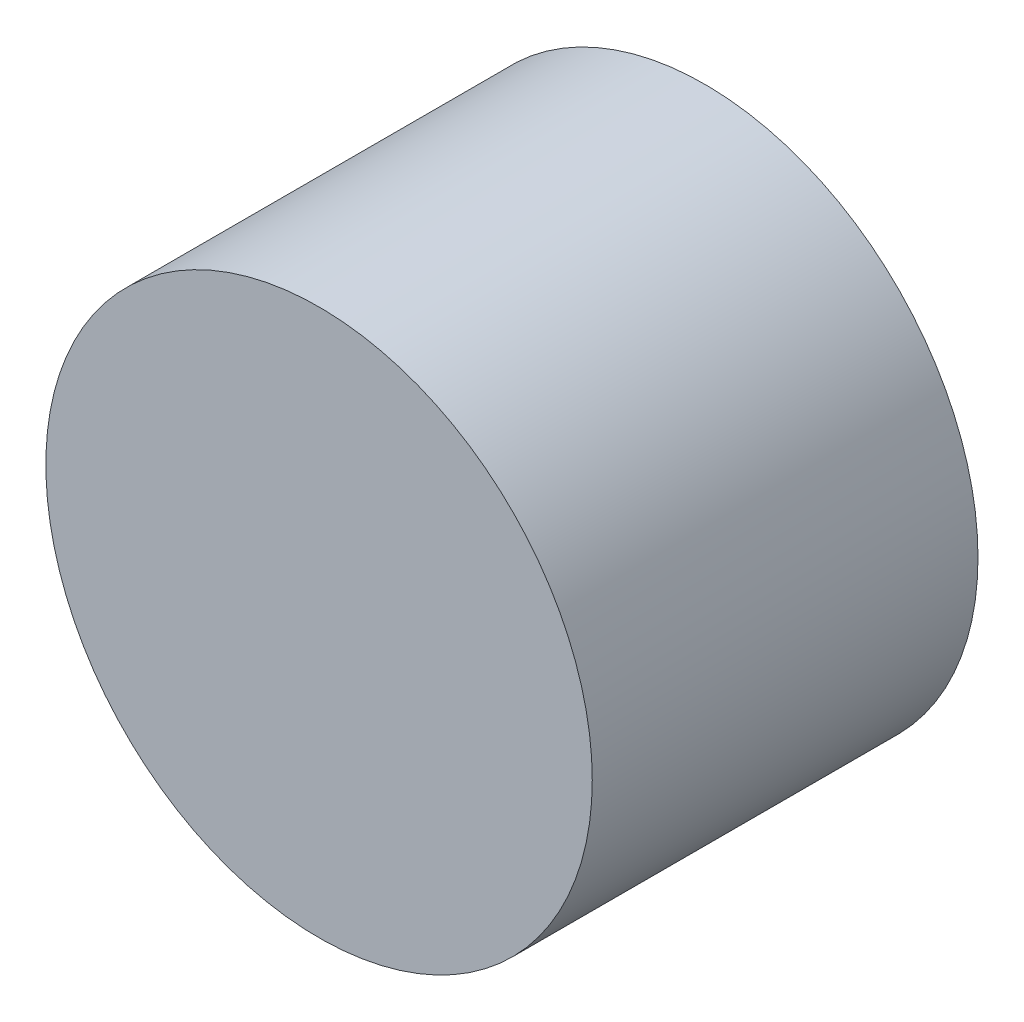
ISO-10303-21;
HEADER;
FILE_DESCRIPTION(('STEP AP214'),'2;1');
FILE_NAME('part.step','',(''),(''),'','','');
FILE_SCHEMA(('AUTOMOTIVE_DESIGN { 1 0 10303 214 1 1 1 1 }'));
ENDSEC;
DATA;
#1=APPLICATION_CONTEXT('core data for automotive mechanical design processes');
#2=APPLICATION_PROTOCOL_DEFINITION('international standard','automotive_design',2000,#1);
#3=PRODUCT_CONTEXT('',#1,'mechanical');
#4=PRODUCT('Part','Part','',(#3));
#5=PRODUCT_RELATED_PRODUCT_CATEGORY('part','',(#4));
#6=PRODUCT_DEFINITION_FORMATION('','',#4);
#7=PRODUCT_DEFINITION_CONTEXT('part definition',#1,'design');
#8=PRODUCT_DEFINITION('design','',#6,#7);
#9=PRODUCT_DEFINITION_SHAPE('','',#8);
#10=(LENGTH_UNIT() NAMED_UNIT(*) SI_UNIT(.MILLI.,.METRE.));
#11=(NAMED_UNIT(*) PLANE_ANGLE_UNIT() SI_UNIT($,.RADIAN.));
#12=(NAMED_UNIT(*) SI_UNIT($,.STERADIAN.) SOLID_ANGLE_UNIT());
#13=UNCERTAINTY_MEASURE_WITH_UNIT(LENGTH_MEASURE(1.E-05),#10,'distance_accuracy_value','');
#14=(GEOMETRIC_REPRESENTATION_CONTEXT(3) GLOBAL_UNCERTAINTY_ASSIGNED_CONTEXT((#13)) GLOBAL_UNIT_ASSIGNED_CONTEXT((#10,
#11,#12)) REPRESENTATION_CONTEXT('',''));
#15=CARTESIAN_POINT('',(0.,0.,0.));
#16=DIRECTION('',(0.,0.,1.));
#17=DIRECTION('',(1.,0.,0.));
#18=AXIS2_PLACEMENT_3D('',#15,#16,#17);
#19=CARTESIAN_POINT('',(0.,0.,12.));
#20=DIRECTION('',(0.,0.,-1.));
#21=DIRECTION('',(-1.,0.,0.));
#22=AXIS2_PLACEMENT_3D('',#19,#20,#21);
#23=CYLINDRICAL_SURFACE('',#22,8.5);
#24=CARTESIAN_POINT('',(0.,0.,12.));
#25=DIRECTION('',(0.,0.,1.));
#26=DIRECTION('',(1.,0.,0.));
#27=AXIS2_PLACEMENT_3D('',#24,#25,#26);
#28=CIRCLE('',#27,8.5);
#29=CARTESIAN_POINT('',(8.5,0.,12.));
#30=VERTEX_POINT('',#29);
#31=EDGE_CURVE('E10',#30,#30,#28,.T.);
#32=ORIENTED_EDGE('',*,*,#31,.F.);
#33=EDGE_LOOP('',(#32));
#34=FACE_BOUND('',#33,.T.);
#35=CARTESIAN_POINT('',(0.,0.,0.));
#36=DIRECTION('',(0.,0.,1.));
#37=DIRECTION('',(1.,0.,0.));
#38=AXIS2_PLACEMENT_3D('',#35,#36,#37);
#39=CIRCLE('',#38,8.5);
#40=CARTESIAN_POINT('',(8.5,0.,0.));
#41=VERTEX_POINT('',#40);
#42=EDGE_CURVE('E33',#41,#41,#39,.T.);
#43=ORIENTED_EDGE('',*,*,#42,.T.);
#44=EDGE_LOOP('',(#43));
#45=FACE_BOUND('',#44,.T.);
#46=ADVANCED_FACE('F30',(#34,#45),#23,.T.);
#47=CARTESIAN_POINT('',(0.,0.,12.));
#48=DIRECTION('',(0.,0.,1.));
#49=DIRECTION('',(1.,0.,0.));
#50=AXIS2_PLACEMENT_3D('',#47,#48,#49);
#51=PLANE('',#50);
#52=ORIENTED_EDGE('',*,*,#31,.T.);
#53=EDGE_LOOP('',(#52));
#54=FACE_BOUND('',#53,.T.);
#55=ADVANCED_FACE('F45',(#54),#51,.T.);
#56=CARTESIAN_POINT('',(0.,0.,0.));
#57=DIRECTION('',(0.,0.,1.));
#58=DIRECTION('',(1.,0.,0.));
#59=AXIS2_PLACEMENT_3D('',#56,#57,#58);
#60=PLANE('',#59);
#61=ORIENTED_EDGE('',*,*,#42,.F.);
#62=EDGE_LOOP('',(#61));
#63=FACE_BOUND('',#62,.T.);
#64=ADVANCED_FACE('F43',(#63),#60,.F.);
#65=CLOSED_SHELL('',(#46,#55,#64));
#66=MANIFOLD_SOLID_BREP('B2',#65);
#67=ADVANCED_BREP_SHAPE_REPRESENTATION('',(#18,#66),#14);
#68=SHAPE_DEFINITION_REPRESENTATION(#9,#67);
ENDSEC;
END-ISO-10303-21;
